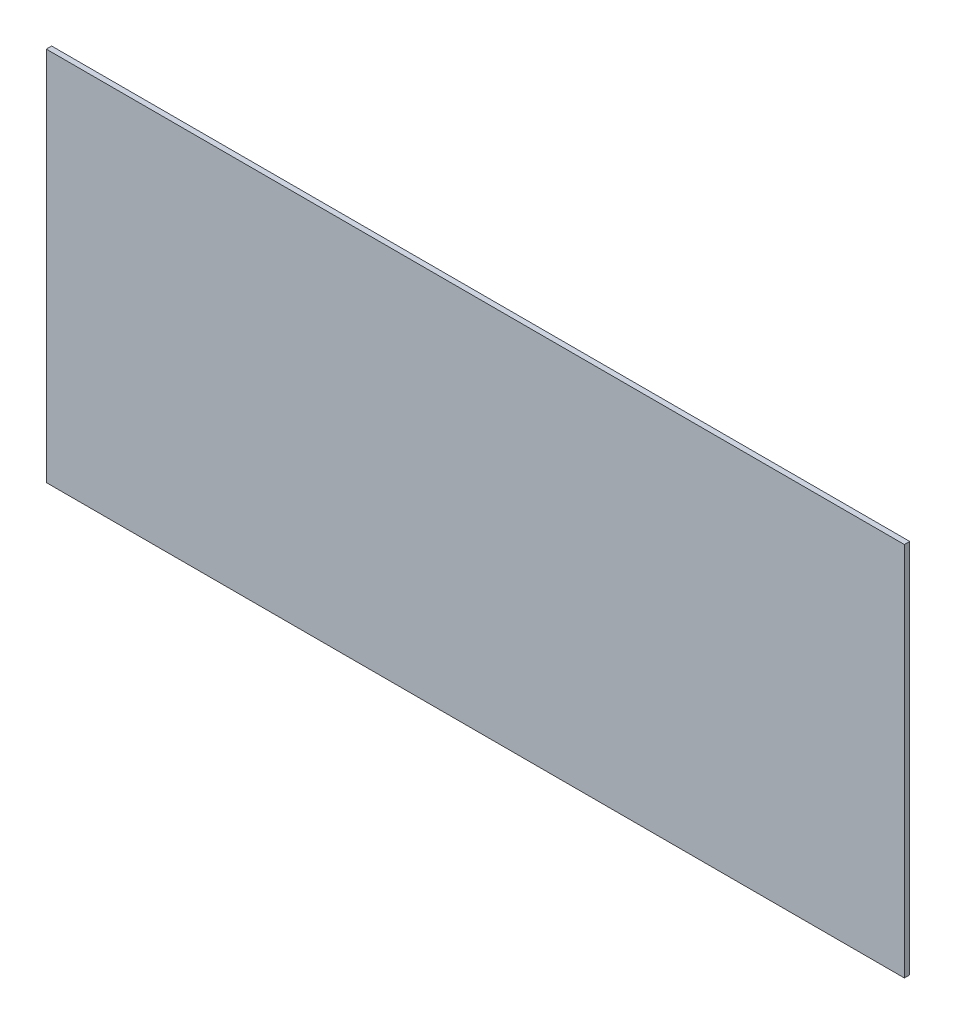
ISO-10303-21;
HEADER;
FILE_DESCRIPTION(('STEP AP214'),'2;1');
FILE_NAME('part.step','',(''),(''),'','','');
FILE_SCHEMA(('AUTOMOTIVE_DESIGN { 1 0 10303 214 1 1 1 1 }'));
ENDSEC;
DATA;
#1=APPLICATION_CONTEXT('core data for automotive mechanical design processes');
#2=APPLICATION_PROTOCOL_DEFINITION('international standard','automotive_design',2000,#1);
#3=PRODUCT_CONTEXT('',#1,'mechanical');
#4=PRODUCT('Part','Part','',(#3));
#5=PRODUCT_RELATED_PRODUCT_CATEGORY('part','',(#4));
#6=PRODUCT_DEFINITION_FORMATION('','',#4);
#7=PRODUCT_DEFINITION_CONTEXT('part definition',#1,'design');
#8=PRODUCT_DEFINITION('design','',#6,#7);
#9=PRODUCT_DEFINITION_SHAPE('','',#8);
#10=(LENGTH_UNIT() NAMED_UNIT(*) SI_UNIT(.MILLI.,.METRE.));
#11=(NAMED_UNIT(*) PLANE_ANGLE_UNIT() SI_UNIT($,.RADIAN.));
#12=(NAMED_UNIT(*) SI_UNIT($,.STERADIAN.) SOLID_ANGLE_UNIT());
#13=UNCERTAINTY_MEASURE_WITH_UNIT(LENGTH_MEASURE(1.E-05),#10,'distance_accuracy_value','');
#14=(GEOMETRIC_REPRESENTATION_CONTEXT(3) GLOBAL_UNCERTAINTY_ASSIGNED_CONTEXT((#13)) GLOBAL_UNIT_ASSIGNED_CONTEXT((#10,
#11,#12)) REPRESENTATION_CONTEXT('',''));
#15=CARTESIAN_POINT('',(0.,0.,0.));
#16=DIRECTION('',(0.,0.,1.));
#17=DIRECTION('',(1.,0.,0.));
#18=AXIS2_PLACEMENT_3D('',#15,#16,#17);
#19=CARTESIAN_POINT('',(0.,0.,0.));
#20=DIRECTION('',(0.,0.,1.));
#21=DIRECTION('',(1.,0.,0.));
#22=AXIS2_PLACEMENT_3D('',#19,#20,#21);
#23=PLANE('',#22);
#24=DIRECTION('',(1.,0.,0.));
#25=VECTOR('',#24,1.);
#26=CARTESIAN_POINT('',(-1182.69511869317,350.,0.));
#27=LINE('',#26,#25);
#28=CARTESIAN_POINT('',(417.304881306829,350.,0.));
#29=VERTEX_POINT('',#28);
#30=CARTESIAN_POINT('',(-1182.69511869317,350.,0.));
#31=VERTEX_POINT('',#30);
#32=EDGE_CURVE('E79',#29,#31,#27,.F.);
#33=ORIENTED_EDGE('',*,*,#32,.F.);
#34=DIRECTION('',(0.,1.,0.));
#35=VECTOR('',#34,1.);
#36=CARTESIAN_POINT('',(417.304881306829,350.,0.));
#37=LINE('',#36,#35);
#38=CARTESIAN_POINT('',(417.304881306829,-350.,0.));
#39=VERTEX_POINT('',#38);
#40=EDGE_CURVE('E55',#39,#29,#37,.T.);
#41=ORIENTED_EDGE('',*,*,#40,.F.);
#42=DIRECTION('',(1.,0.,0.));
#43=VECTOR('',#42,1.);
#44=CARTESIAN_POINT('',(-1182.69511869317,-350.,0.));
#45=LINE('',#44,#43);
#46=CARTESIAN_POINT('',(-1182.69511869317,-350.,0.));
#47=VERTEX_POINT('',#46);
#48=EDGE_CURVE('E67',#39,#47,#45,.F.);
#49=ORIENTED_EDGE('',*,*,#48,.T.);
#50=DIRECTION('',(0.,1.,0.));
#51=VECTOR('',#50,1.);
#52=CARTESIAN_POINT('',(-1182.69511869317,350.,0.));
#53=LINE('',#52,#51);
#54=EDGE_CURVE('E20',#47,#31,#53,.T.);
#55=ORIENTED_EDGE('',*,*,#54,.T.);
#56=EDGE_LOOP('',(#33,#41,#49,#55));
#57=FACE_BOUND('',#56,.T.);
#58=ADVANCED_FACE('F17',(#57),#23,.F.);
#59=CARTESIAN_POINT('',(-1182.69511869317,350.,10.));
#60=DIRECTION('',(1.,0.,0.));
#61=DIRECTION('',(0.,1.,0.));
#62=AXIS2_PLACEMENT_3D('',#59,#60,#61);
#63=PLANE('',#62);
#64=DIRECTION('',(0.,0.,1.));
#65=VECTOR('',#64,1.);
#66=CARTESIAN_POINT('',(-1182.69511869317,-350.,10.));
#67=LINE('',#66,#65);
#68=CARTESIAN_POINT('',(-1182.69511869317,-350.,10.));
#69=VERTEX_POINT('',#68);
#70=EDGE_CURVE('E62',#47,#69,#67,.T.);
#71=ORIENTED_EDGE('',*,*,#70,.T.);
#72=DIRECTION('',(0.,1.,0.));
#73=VECTOR('',#72,1.);
#74=CARTESIAN_POINT('',(-1182.69511869317,0.,10.));
#75=LINE('',#74,#73);
#76=CARTESIAN_POINT('',(-1182.69511869317,350.,10.));
#77=VERTEX_POINT('',#76);
#78=EDGE_CURVE('E83',#77,#69,#75,.F.);
#79=ORIENTED_EDGE('',*,*,#78,.F.);
#80=DIRECTION('',(0.,0.,1.));
#81=VECTOR('',#80,1.);
#82=CARTESIAN_POINT('',(-1182.69511869317,350.,10.));
#83=LINE('',#82,#81);
#84=EDGE_CURVE('E65',#31,#77,#83,.T.);
#85=ORIENTED_EDGE('',*,*,#84,.F.);
#86=ORIENTED_EDGE('',*,*,#54,.F.);
#87=EDGE_LOOP('',(#71,#79,#85,#86));
#88=FACE_BOUND('',#87,.T.);
#89=ADVANCED_FACE('F60',(#88),#63,.F.);
#90=CARTESIAN_POINT('',(-1182.69511869317,-350.,10.));
#91=DIRECTION('',(0.,1.,0.));
#92=DIRECTION('',(0.,0.,1.));
#93=AXIS2_PLACEMENT_3D('',#90,#91,#92);
#94=PLANE('',#93);
#95=DIRECTION('',(0.,0.,1.));
#96=VECTOR('',#95,1.);
#97=CARTESIAN_POINT('',(417.304881306829,-350.,10.));
#98=LINE('',#97,#96);
#99=CARTESIAN_POINT('',(417.304881306829,-350.,10.));
#100=VERTEX_POINT('',#99);
#101=EDGE_CURVE('E77',#100,#39,#98,.F.);
#102=ORIENTED_EDGE('',*,*,#101,.F.);
#103=DIRECTION('',(1.,0.,0.));
#104=VECTOR('',#103,1.);
#105=CARTESIAN_POINT('',(0.,-350.,10.));
#106=LINE('',#105,#104);
#107=EDGE_CURVE('E73',#69,#100,#106,.T.);
#108=ORIENTED_EDGE('',*,*,#107,.F.);
#109=ORIENTED_EDGE('',*,*,#70,.F.);
#110=ORIENTED_EDGE('',*,*,#48,.F.);
#111=EDGE_LOOP('',(#102,#108,#109,#110));
#112=FACE_BOUND('',#111,.T.);
#113=ADVANCED_FACE('F71',(#112),#94,.F.);
#114=CARTESIAN_POINT('',(417.304881306829,350.,10.));
#115=DIRECTION('',(1.,0.,0.));
#116=DIRECTION('',(0.,1.,0.));
#117=AXIS2_PLACEMENT_3D('',#114,#115,#116);
#118=PLANE('',#117);
#119=DIRECTION('',(0.,1.,0.));
#120=VECTOR('',#119,1.);
#121=CARTESIAN_POINT('',(417.304881306829,0.,10.));
#122=LINE('',#121,#120);
#123=CARTESIAN_POINT('',(417.304881306829,350.,10.));
#124=VERTEX_POINT('',#123);
#125=EDGE_CURVE('E26',#100,#124,#122,.T.);
#126=ORIENTED_EDGE('',*,*,#125,.F.);
#127=ORIENTED_EDGE('',*,*,#101,.T.);
#128=ORIENTED_EDGE('',*,*,#40,.T.);
#129=DIRECTION('',(0.,0.,1.));
#130=VECTOR('',#129,1.);
#131=CARTESIAN_POINT('',(417.304881306829,350.,10.));
#132=LINE('',#131,#130);
#133=EDGE_CURVE('E35',#124,#29,#132,.F.);
#134=ORIENTED_EDGE('',*,*,#133,.F.);
#135=EDGE_LOOP('',(#126,#127,#128,#134));
#136=FACE_BOUND('',#135,.T.);
#137=ADVANCED_FACE('F89',(#136),#118,.T.);
#138=CARTESIAN_POINT('',(-1182.69511869317,350.,10.));
#139=DIRECTION('',(0.,1.,0.));
#140=DIRECTION('',(0.,0.,1.));
#141=AXIS2_PLACEMENT_3D('',#138,#139,#140);
#142=PLANE('',#141);
#143=DIRECTION('',(1.,0.,0.));
#144=VECTOR('',#143,1.);
#145=CARTESIAN_POINT('',(0.,350.,10.));
#146=LINE('',#145,#144);
#147=EDGE_CURVE('E11',#124,#77,#146,.F.);
#148=ORIENTED_EDGE('',*,*,#147,.F.);
#149=ORIENTED_EDGE('',*,*,#133,.T.);
#150=ORIENTED_EDGE('',*,*,#32,.T.);
#151=ORIENTED_EDGE('',*,*,#84,.T.);
#152=EDGE_LOOP('',(#148,#149,#150,#151));
#153=FACE_BOUND('',#152,.T.);
#154=ADVANCED_FACE('F91',(#153),#142,.T.);
#155=CARTESIAN_POINT('',(0.,0.,10.));
#156=DIRECTION('',(0.,0.,1.));
#157=DIRECTION('',(1.,0.,0.));
#158=AXIS2_PLACEMENT_3D('',#155,#156,#157);
#159=PLANE('',#158);
#160=ORIENTED_EDGE('',*,*,#125,.T.);
#161=ORIENTED_EDGE('',*,*,#147,.T.);
#162=ORIENTED_EDGE('',*,*,#78,.T.);
#163=ORIENTED_EDGE('',*,*,#107,.T.);
#164=EDGE_LOOP('',(#160,#161,#162,#163));
#165=FACE_BOUND('',#164,.T.);
#166=ADVANCED_FACE('F88',(#165),#159,.T.);
#167=CLOSED_SHELL('',(#58,#89,#113,#137,#154,#166));
#168=MANIFOLD_SOLID_BREP('B1',#167);
#169=ADVANCED_BREP_SHAPE_REPRESENTATION('',(#18,#168),#14);
#170=SHAPE_DEFINITION_REPRESENTATION(#9,#169);
ENDSEC;
END-ISO-10303-21;
